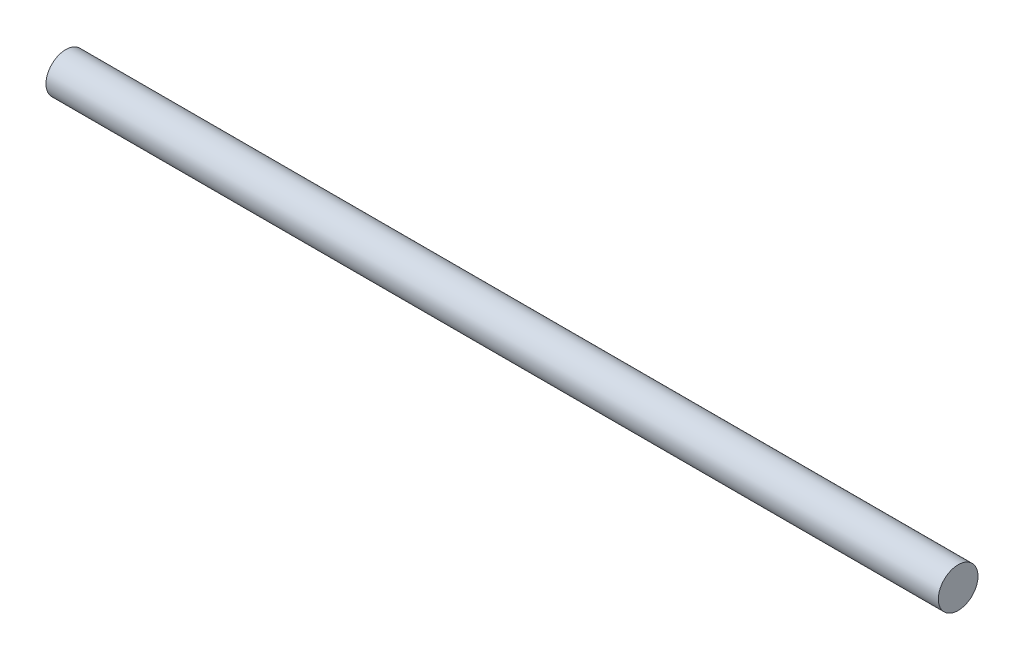
ISO-10303-21;
HEADER;
FILE_DESCRIPTION(('STEP AP214'),'2;1');
FILE_NAME('part.step','',(''),(''),'','','');
FILE_SCHEMA(('AUTOMOTIVE_DESIGN { 1 0 10303 214 1 1 1 1 }'));
ENDSEC;
DATA;
#1=APPLICATION_CONTEXT('core data for automotive mechanical design processes');
#2=APPLICATION_PROTOCOL_DEFINITION('international standard','automotive_design',2000,#1);
#3=PRODUCT_CONTEXT('',#1,'mechanical');
#4=PRODUCT('Part','Part','',(#3));
#5=PRODUCT_RELATED_PRODUCT_CATEGORY('part','',(#4));
#6=PRODUCT_DEFINITION_FORMATION('','',#4);
#7=PRODUCT_DEFINITION_CONTEXT('part definition',#1,'design');
#8=PRODUCT_DEFINITION('design','',#6,#7);
#9=PRODUCT_DEFINITION_SHAPE('','',#8);
#10=(LENGTH_UNIT() NAMED_UNIT(*) SI_UNIT(.MILLI.,.METRE.));
#11=(NAMED_UNIT(*) PLANE_ANGLE_UNIT() SI_UNIT($,.RADIAN.));
#12=(NAMED_UNIT(*) SI_UNIT($,.STERADIAN.) SOLID_ANGLE_UNIT());
#13=UNCERTAINTY_MEASURE_WITH_UNIT(LENGTH_MEASURE(1.E-05),#10,'distance_accuracy_value','');
#14=(GEOMETRIC_REPRESENTATION_CONTEXT(3) GLOBAL_UNCERTAINTY_ASSIGNED_CONTEXT((#13)) GLOBAL_UNIT_ASSIGNED_CONTEXT((#10,
#11,#12)) REPRESENTATION_CONTEXT('',''));
#15=CARTESIAN_POINT('',(0.,0.,0.));
#16=DIRECTION('',(0.,0.,1.));
#17=DIRECTION('',(1.,0.,0.));
#18=AXIS2_PLACEMENT_3D('',#15,#16,#17);
#19=CARTESIAN_POINT('',(450.,0.,0.));
#20=DIRECTION('',(-1.,0.,0.));
#21=DIRECTION('',(0.,0.,1.));
#22=AXIS2_PLACEMENT_3D('',#19,#20,#21);
#23=CYLINDRICAL_SURFACE('',#22,10.);
#24=CARTESIAN_POINT('',(450.,0.,0.));
#25=DIRECTION('',(1.,0.,0.));
#26=DIRECTION('',(0.,0.,-1.));
#27=AXIS2_PLACEMENT_3D('',#24,#25,#26);
#28=CIRCLE('',#27,10.);
#29=CARTESIAN_POINT('',(450.,0.,-10.));
#30=VERTEX_POINT('',#29);
#31=EDGE_CURVE('E10',#30,#30,#28,.T.);
#32=ORIENTED_EDGE('',*,*,#31,.F.);
#33=EDGE_LOOP('',(#32));
#34=FACE_BOUND('',#33,.T.);
#35=CARTESIAN_POINT('',(0.,0.,0.));
#36=DIRECTION('',(1.,0.,0.));
#37=DIRECTION('',(0.,0.,-1.));
#38=AXIS2_PLACEMENT_3D('',#35,#36,#37);
#39=CIRCLE('',#38,10.);
#40=CARTESIAN_POINT('',(0.,0.,-10.));
#41=VERTEX_POINT('',#40);
#42=EDGE_CURVE('E38',#41,#41,#39,.T.);
#43=ORIENTED_EDGE('',*,*,#42,.T.);
#44=EDGE_LOOP('',(#43));
#45=FACE_BOUND('',#44,.T.);
#46=ADVANCED_FACE('F35',(#34,#45),#23,.T.);
#47=CARTESIAN_POINT('',(450.,0.,0.));
#48=DIRECTION('',(1.,0.,0.));
#49=DIRECTION('',(0.,0.,-1.));
#50=AXIS2_PLACEMENT_3D('',#47,#48,#49);
#51=PLANE('',#50);
#52=ORIENTED_EDGE('',*,*,#31,.T.);
#53=EDGE_LOOP('',(#52));
#54=FACE_BOUND('',#53,.T.);
#55=ADVANCED_FACE('F50',(#54),#51,.T.);
#56=CARTESIAN_POINT('',(0.,0.,0.));
#57=DIRECTION('',(1.,0.,0.));
#58=DIRECTION('',(0.,0.,-1.));
#59=AXIS2_PLACEMENT_3D('',#56,#57,#58);
#60=PLANE('',#59);
#61=ORIENTED_EDGE('',*,*,#42,.F.);
#62=EDGE_LOOP('',(#61));
#63=FACE_BOUND('',#62,.T.);
#64=ADVANCED_FACE('F48',(#63),#60,.F.);
#65=CLOSED_SHELL('',(#46,#55,#64));
#66=MANIFOLD_SOLID_BREP('B2',#65);
#67=ADVANCED_BREP_SHAPE_REPRESENTATION('',(#18,#66),#14);
#68=SHAPE_DEFINITION_REPRESENTATION(#9,#67);
ENDSEC;
END-ISO-10303-21;
